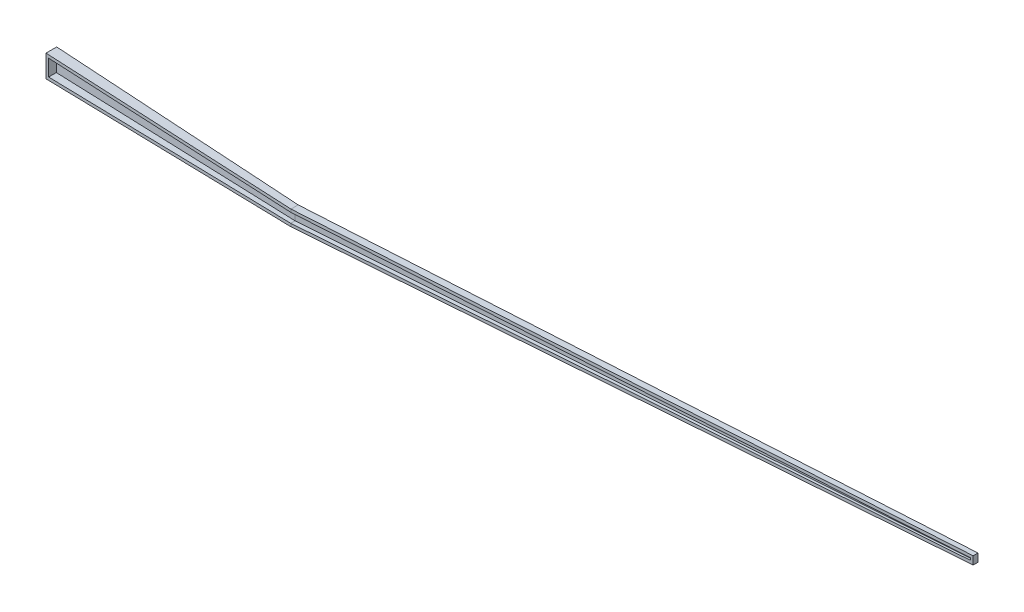
ISO-10303-21;
HEADER;
FILE_DESCRIPTION(('STEP AP214'),'2;1');
FILE_NAME('part.step','',(''),(''),'','','');
FILE_SCHEMA(('AUTOMOTIVE_DESIGN { 1 0 10303 214 1 1 1 1 }'));
ENDSEC;
DATA;
#1=APPLICATION_CONTEXT('core data for automotive mechanical design processes');
#2=APPLICATION_PROTOCOL_DEFINITION('international standard','automotive_design',2000,#1);
#3=PRODUCT_CONTEXT('',#1,'mechanical');
#4=PRODUCT('Part','Part','',(#3));
#5=PRODUCT_RELATED_PRODUCT_CATEGORY('part','',(#4));
#6=PRODUCT_DEFINITION_FORMATION('','',#4);
#7=PRODUCT_DEFINITION_CONTEXT('part definition',#1,'design');
#8=PRODUCT_DEFINITION('design','',#6,#7);
#9=PRODUCT_DEFINITION_SHAPE('','',#8);
#10=(LENGTH_UNIT() NAMED_UNIT(*) SI_UNIT(.MILLI.,.METRE.));
#11=(NAMED_UNIT(*) PLANE_ANGLE_UNIT() SI_UNIT($,.RADIAN.));
#12=(NAMED_UNIT(*) SI_UNIT($,.STERADIAN.) SOLID_ANGLE_UNIT());
#13=UNCERTAINTY_MEASURE_WITH_UNIT(LENGTH_MEASURE(1.E-05),#10,'distance_accuracy_value','');
#14=(GEOMETRIC_REPRESENTATION_CONTEXT(3) GLOBAL_UNCERTAINTY_ASSIGNED_CONTEXT((#13)) GLOBAL_UNIT_ASSIGNED_CONTEXT((#10,
#11,#12)) REPRESENTATION_CONTEXT('',''));
#15=CARTESIAN_POINT('',(0.,0.,0.));
#16=DIRECTION('',(0.,0.,1.));
#17=DIRECTION('',(1.,0.,0.));
#18=AXIS2_PLACEMENT_3D('',#15,#16,#17);
#19=CARTESIAN_POINT('',(-27.6683419660114,0.,256.547332608968));
#20=DIRECTION('',(0.107227081332726,0.,-0.994234556344158));
#21=DIRECTION('',(-0.994234556344158,0.,-0.107227081332726));
#22=AXIS2_PLACEMENT_3D('',#19,#20,#21);
#23=PLANE('',#22);
#24=DIRECTION('',(0.989050782276175,0.101982764246963,0.106668017115886));
#25=VECTOR('',#24,1.);
#26=CARTESIAN_POINT('',(-15.9796338971619,-114.678133572057,257.807946659018));
#27=LINE('',#26,#25);
#28=CARTESIAN_POINT('',(939.052877239833,-16.2030530435097,360.807131402338));
#29=VERTEX_POINT('',#28);
#30=CARTESIAN_POINT('',(940.,-16.1053935513037,360.909277529314));
#31=VERTEX_POINT('',#30);
#32=EDGE_CURVE('E202',#29,#31,#27,.T.);
#33=ORIENTED_EDGE('',*,*,#32,.F.);
#34=DIRECTION('',(0.990521140499442,0.0863478379775976,0.106826593600468));
#35=VECTOR('',#34,1.);
#36=CARTESIAN_POINT('',(-19.0746809991996,-99.7270080385337,257.474149301824));
#37=LINE('',#36,#35);
#38=CARTESIAN_POINT('',(10.,-97.1924474506563,260.60982102469));
#39=VERTEX_POINT('',#38);
#40=EDGE_CURVE('E175',#39,#29,#37,.T.);
#41=ORIENTED_EDGE('',*,*,#40,.F.);
#42=DIRECTION('',(0.,-1.,0.));
#43=VECTOR('',#42,1.);
#44=CARTESIAN_POINT('',(10.,0.,260.60982102469));
#45=LINE('',#44,#43);
#46=CARTESIAN_POINT('',(10.,-41.2284540604462,260.60982102469));
#47=VERTEX_POINT('',#46);
#48=EDGE_CURVE('E153',#47,#39,#45,.T.);
#49=ORIENTED_EDGE('',*,*,#48,.F.);
#50=DIRECTION('',(0.992348001521647,0.0615742556318157,0.107023618511905));
#51=VECTOR('',#50,1.);
#52=CARTESIAN_POINT('',(-25.0063407109826,-43.4005644172639,256.834426457456));
#53=LINE('',#52,#51);
#54=CARTESIAN_POINT('',(940.,16.4771670017024,360.909277529314));
#55=VERTEX_POINT('',#54);
#56=EDGE_CURVE('E165',#47,#55,#53,.T.);
#57=ORIENTED_EDGE('',*,*,#56,.T.);
#58=DIRECTION('',(0.,-1.,0.));
#59=VECTOR('',#58,1.);
#60=CARTESIAN_POINT('',(940.,26.496398934414,360.909277529314));
#61=LINE('',#60,#59);
#62=CARTESIAN_POINT('',(940.,26.496398934414,360.909277529314));
#63=VERTEX_POINT('',#62);
#64=EDGE_CURVE('E49',#63,#55,#61,.T.);
#65=ORIENTED_EDGE('',*,*,#64,.F.);
#66=DIRECTION('',(0.992348001521646,0.0615742556318157,0.107023618511905));
#67=VECTOR('',#66,1.);
#68=CARTESIAN_POINT('',(0.,-31.82971267679,259.53133224507));
#69=LINE('',#68,#67);
#70=CARTESIAN_POINT('',(0.,-31.82971267679,259.53133224507));
#71=VERTEX_POINT('',#70);
#72=EDGE_CURVE('E494',#71,#63,#69,.T.);
#73=ORIENTED_EDGE('',*,*,#72,.F.);
#74=DIRECTION('',(0.,-1.,0.));
#75=VECTOR('',#74,1.);
#76=CARTESIAN_POINT('',(0.,-31.82971267679,259.53133224507));
#77=LINE('',#76,#75);
#78=CARTESIAN_POINT('',(0.,-108.102113692959,259.53133224507));
#79=VERTEX_POINT('',#78);
#80=EDGE_CURVE('E479',#71,#79,#77,.T.);
#81=ORIENTED_EDGE('',*,*,#80,.T.);
#82=DIRECTION('',(0.990521140499442,0.0863478379775976,0.106826593600468));
#83=VECTOR('',#82,1.);
#84=CARTESIAN_POINT('',(0.,-108.102113692959,259.53133224507));
#85=LINE('',#84,#83);
#86=CARTESIAN_POINT('',(940.,-26.1584131698027,360.909277529314));
#87=VERTEX_POINT('',#86);
#88=EDGE_CURVE('E487',#79,#87,#85,.T.);
#89=ORIENTED_EDGE('',*,*,#88,.T.);
#90=EDGE_CURVE('E43',#31,#87,#61,.T.);
#91=ORIENTED_EDGE('',*,*,#90,.F.);
#92=EDGE_LOOP('',(#33,#41,#49,#57,#65,#73,#81,#89,#91));
#93=FACE_BOUND('',#92,.T.);
#94=ADVANCED_FACE('F38',(#93),#23,.F.);
#95=CARTESIAN_POINT('',(0.,0.,0.));
#96=DIRECTION('',(-1.,0.,0.));
#97=DIRECTION('',(0.,0.,1.));
#98=AXIS2_PLACEMENT_3D('',#95,#96,#97);
#99=PLANE('',#98);
#100=DIRECTION('',(0.,1.,0.));
#101=VECTOR('',#100,1.);
#102=CARTESIAN_POINT('',(0.,-31.82971267679,222.920579757309));
#103=LINE('',#102,#101);
#104=CARTESIAN_POINT('',(0.,-108.102113692959,222.920579757309));
#105=VERTEX_POINT('',#104);
#106=CARTESIAN_POINT('',(0.,-31.82971267679,222.920579757309));
#107=VERTEX_POINT('',#106);
#108=EDGE_CURVE('E319',#105,#107,#103,.T.);
#109=ORIENTED_EDGE('',*,*,#108,.F.);
#110=DIRECTION('',(0.,0.,-1.));
#111=VECTOR('',#110,1.);
#112=CARTESIAN_POINT('',(0.,-108.102113692959,222.920579757309));
#113=LINE('',#112,#111);
#114=EDGE_CURVE('E473',#79,#105,#113,.T.);
#115=ORIENTED_EDGE('',*,*,#114,.F.);
#116=ORIENTED_EDGE('',*,*,#80,.F.);
#117=DIRECTION('',(0.,0.,1.));
#118=VECTOR('',#117,1.);
#119=CARTESIAN_POINT('',(0.,-31.82971267679,222.920579757309));
#120=LINE('',#119,#118);
#121=EDGE_CURVE('E381',#107,#71,#120,.T.);
#122=ORIENTED_EDGE('',*,*,#121,.F.);
#123=EDGE_LOOP('',(#109,#115,#116,#122));
#124=FACE_BOUND('',#123,.T.);
#125=ADVANCED_FACE('F399',(#124),#99,.T.);
#126=CARTESIAN_POINT('',(1.96742882089534,-31.7076355778595,0.));
#127=DIRECTION('',(0.0619299516392605,-0.998080498301594,0.));
#128=DIRECTION('',(0.998080498301595,0.0619299516392605,0.));
#129=AXIS2_PLACEMENT_3D('',#126,#127,#128);
#130=PLANE('',#129);
#131=ORIENTED_EDGE('',*,*,#72,.T.);
#132=DIRECTION('',(0.,0.,1.));
#133=VECTOR('',#132,1.);
#134=CARTESIAN_POINT('',(940.,26.496398934414,336.130542421448));
#135=LINE('',#134,#133);
#136=CARTESIAN_POINT('',(940.,26.496398934414,336.130542421448));
#137=VERTEX_POINT('',#136);
#138=EDGE_CURVE('E11',#137,#63,#135,.T.);
#139=ORIENTED_EDGE('',*,*,#138,.F.);
#140=DIRECTION('',(0.990946963731779,0.0614873225610675,0.1193458178364));
#141=VECTOR('',#140,1.);
#142=CARTESIAN_POINT('',(0.,-31.82971267679,222.920579757309));
#143=LINE('',#142,#141);
#144=EDGE_CURVE('E387',#107,#137,#143,.T.);
#145=ORIENTED_EDGE('',*,*,#144,.F.);
#146=ORIENTED_EDGE('',*,*,#121,.T.);
#147=EDGE_LOOP('',(#131,#139,#145,#146));
#148=FACE_BOUND('',#147,.T.);
#149=ADVANCED_FACE('F389',(#148),#130,.F.);
#150=CARTESIAN_POINT('',(9.35263603010326,-107.28680560152,0.));
#151=DIRECTION('',(-0.0868447928098985,0.996221853786498,0.));
#152=DIRECTION('',(-0.996221853786498,-0.0868447928098985,0.));
#153=AXIS2_PLACEMENT_3D('',#150,#151,#152);
#154=PLANE('',#153);
#155=DIRECTION('',(0.989127815337359,0.0862263760416262,0.119126726642982));
#156=VECTOR('',#155,1.);
#157=CARTESIAN_POINT('',(0.,-108.102113692959,222.920579757309));
#158=LINE('',#157,#156);
#159=CARTESIAN_POINT('',(940.,-26.1584131698026,336.130542421448));
#160=VERTEX_POINT('',#159);
#161=EDGE_CURVE('E492',#105,#160,#158,.T.);
#162=ORIENTED_EDGE('',*,*,#161,.T.);
#163=DIRECTION('',(0.,0.,-1.));
#164=VECTOR('',#163,1.);
#165=CARTESIAN_POINT('',(940.,-26.1584131698027,336.130542421448));
#166=LINE('',#165,#164);
#167=EDGE_CURVE('E438',#87,#160,#166,.T.);
#168=ORIENTED_EDGE('',*,*,#167,.F.);
#169=ORIENTED_EDGE('',*,*,#88,.F.);
#170=ORIENTED_EDGE('',*,*,#114,.T.);
#171=EDGE_LOOP('',(#162,#168,#169,#170));
#172=FACE_BOUND('',#171,.T.);
#173=ADVANCED_FACE('F398',(#172),#154,.F.);
#174=CARTESIAN_POINT('',(-26.4638377315925,0.,219.733377542901));
#175=DIRECTION('',(-0.119572064384979,0.,0.99282552415755));
#176=DIRECTION('',(0.99282552415755,0.,0.119572064384979));
#177=AXIS2_PLACEMENT_3D('',#174,#175,#176);
#178=PLANE('',#177);
#179=ORIENTED_EDGE('',*,*,#144,.T.);
#180=DIRECTION('',(0.,1.,0.));
#181=VECTOR('',#180,1.);
#182=CARTESIAN_POINT('',(940.,26.496398934414,336.130542421448));
#183=LINE('',#182,#181);
#184=EDGE_CURVE('E268',#160,#137,#183,.T.);
#185=ORIENTED_EDGE('',*,*,#184,.F.);
#186=ORIENTED_EDGE('',*,*,#161,.F.);
#187=ORIENTED_EDGE('',*,*,#108,.T.);
#188=EDGE_LOOP('',(#179,#185,#186,#187));
#189=FACE_BOUND('',#188,.T.);
#190=ADVANCED_FACE('F40',(#189),#178,.F.);
#191=CARTESIAN_POINT('',(3360.,0.,0.));
#192=DIRECTION('',(1.,0.,0.));
#193=DIRECTION('',(0.,0.,-1.));
#194=AXIS2_PLACEMENT_3D('',#191,#192,#193);
#195=PLANE('',#194);
#196=DIRECTION('',(0.,-1.,0.));
#197=VECTOR('',#196,1.);
#198=CARTESIAN_POINT('',(3360.,250.933091078658,445.49960602284));
#199=LINE('',#198,#197);
#200=CARTESIAN_POINT('',(3360.,250.933091078658,445.49960602284));
#201=VERTEX_POINT('',#200);
#202=CARTESIAN_POINT('',(3360.,223.372039563549,445.49960602284));
#203=VERTEX_POINT('',#202);
#204=EDGE_CURVE('E219',#201,#203,#199,.T.);
#205=ORIENTED_EDGE('',*,*,#204,.T.);
#206=DIRECTION('',(0.,0.,-1.));
#207=VECTOR('',#206,1.);
#208=CARTESIAN_POINT('',(3360.,223.372039563549,445.49960602284));
#209=LINE('',#208,#207);
#210=CARTESIAN_POINT('',(3360.,223.372039563549,429.051881731565));
#211=VERTEX_POINT('',#210);
#212=EDGE_CURVE('E309',#203,#211,#209,.T.);
#213=ORIENTED_EDGE('',*,*,#212,.T.);
#214=DIRECTION('',(0.,1.,0.));
#215=VECTOR('',#214,1.);
#216=CARTESIAN_POINT('',(3360.,250.933091078658,429.051881731565));
#217=LINE('',#216,#215);
#218=CARTESIAN_POINT('',(3360.,250.933091078658,429.051881731565));
#219=VERTEX_POINT('',#218);
#220=EDGE_CURVE('E341',#211,#219,#217,.T.);
#221=ORIENTED_EDGE('',*,*,#220,.T.);
#222=DIRECTION('',(0.,0.,1.));
#223=VECTOR('',#222,1.);
#224=CARTESIAN_POINT('',(3360.,250.933091078658,445.49960602284));
#225=LINE('',#224,#223);
#226=EDGE_CURVE('E227',#219,#201,#225,.T.);
#227=ORIENTED_EDGE('',*,*,#226,.T.);
#228=EDGE_LOOP('',(#205,#213,#221,#227));
#229=FACE_BOUND('',#228,.T.);
#230=ADVANCED_FACE('F246',(#229),#195,.T.);
#231=CARTESIAN_POINT('',(5.57975672891792,-60.1640095252477,0.));
#232=DIRECTION('',(-0.0923461431479787,0.995726965510974,0.));
#233=DIRECTION('',(-0.995726965510975,-0.0923461431479787,0.));
#234=AXIS2_PLACEMENT_3D('',#231,#232,#233);
#235=PLANE('',#234);
#236=DIRECTION('',(-0.994999997689863,-0.0922787223822492,-0.038205261321862));
#237=VECTOR('',#236,1.);
#238=CARTESIAN_POINT('',(3360.,250.933091078658,429.051881731565));
#239=LINE('',#238,#237);
#240=EDGE_CURVE('E233',#219,#137,#239,.T.);
#241=ORIENTED_EDGE('',*,*,#240,.T.);
#242=ORIENTED_EDGE('',*,*,#138,.T.);
#243=DIRECTION('',(-0.995124396020932,-0.0922902593863539,-0.034784256012947));
#244=VECTOR('',#243,1.);
#245=CARTESIAN_POINT('',(3360.,250.933091078658,445.49960602284));
#246=LINE('',#245,#244);
#247=EDGE_CURVE('E301',#201,#63,#246,.T.);
#248=ORIENTED_EDGE('',*,*,#247,.F.);
#249=ORIENTED_EDGE('',*,*,#226,.F.);
#250=EDGE_LOOP('',(#241,#242,#248,#249));
#251=FACE_BOUND('',#250,.T.);
#252=ADVANCED_FACE('F235',(#251),#235,.T.);
#253=CARTESIAN_POINT('',(-11.4529552220833,0.,327.651542806847));
#254=DIRECTION('',(-0.0349333464098144,0.,0.999389644387319));
#255=DIRECTION('',(0.999389644387319,0.,0.0349333464098144));
#256=AXIS2_PLACEMENT_3D('',#253,#254,#255);
#257=PLANE('',#256);
#258=DIRECTION('',(-0.997473648552157,-0.0618922971858383,-0.0348663733862241));
#259=VECTOR('',#258,1.);
#260=CARTESIAN_POINT('',(-8.82549914049115,-42.3965584902387,327.743384696535));
#261=LINE('',#260,#259);
#262=CARTESIAN_POINT('',(940.771559993538,16.5250415701044,360.936247162912));
#263=VERTEX_POINT('',#262);
#264=EDGE_CURVE('E215',#263,#55,#261,.T.);
#265=ORIENTED_EDGE('',*,*,#264,.F.);
#266=DIRECTION('',(-0.995124396020932,-0.0922902593863539,-0.034784256012947));
#267=VECTOR('',#266,1.);
#268=CARTESIAN_POINT('',(-4.86005514028849,-71.1751368132239,327.881995527361));
#269=LINE('',#268,#267);
#270=CARTESIAN_POINT('',(3350.,239.962753014272,445.150059210883));
#271=VERTEX_POINT('',#270);
#272=EDGE_CURVE('E186',#271,#263,#269,.T.);
#273=ORIENTED_EDGE('',*,*,#272,.F.);
#274=DIRECTION('',(0.,-1.,0.));
#275=VECTOR('',#274,1.);
#276=CARTESIAN_POINT('',(3350.,0.,445.150059210883));
#277=LINE('',#276,#275);
#278=CARTESIAN_POINT('',(3350.,232.393941608769,445.150059210883));
#279=VERTEX_POINT('',#278);
#280=EDGE_CURVE('E196',#271,#279,#277,.T.);
#281=ORIENTED_EDGE('',*,*,#280,.T.);
#282=DIRECTION('',(-0.994125245499023,-0.102506001067366,-0.0347493310249872));
#283=VECTOR('',#282,1.);
#284=CARTESIAN_POINT('',(0.185618777664764,-113.011305961107,328.05836545058));
#285=LINE('',#284,#283);
#286=EDGE_CURVE('E57',#279,#31,#285,.T.);
#287=ORIENTED_EDGE('',*,*,#286,.T.);
#288=ORIENTED_EDGE('',*,*,#90,.T.);
#289=DIRECTION('',(-0.994125245499023,-0.102506001067366,-0.0347493310249872));
#290=VECTOR('',#289,1.);
#291=CARTESIAN_POINT('',(3360.,223.372039563549,445.49960602284));
#292=LINE('',#291,#290);
#293=EDGE_CURVE('E300',#203,#87,#292,.T.);
#294=ORIENTED_EDGE('',*,*,#293,.F.);
#295=ORIENTED_EDGE('',*,*,#204,.F.);
#296=ORIENTED_EDGE('',*,*,#247,.T.);
#297=ORIENTED_EDGE('',*,*,#64,.T.);
#298=EDGE_LOOP('',(#265,#273,#281,#287,#288,#294,#295,#296,#297));
#299=FACE_BOUND('',#298,.T.);
#300=ADVANCED_FACE('F245',(#299),#257,.T.);
#301=CARTESIAN_POINT('',(-11.5036395950585,0.,299.595421533173));
#302=DIRECTION('',(0.03836897344482,0.,-0.999263639825242));
#303=DIRECTION('',(-0.999263639825242,0.,-0.03836897344482));
#304=AXIS2_PLACEMENT_3D('',#301,#302,#303);
#305=PLANE('',#304);
#306=DIRECTION('',(-0.994001221450069,-0.102493212729727,-0.0381669110632369));
#307=VECTOR('',#306,1.);
#308=CARTESIAN_POINT('',(3360.,223.372039563549,429.051881731565));
#309=LINE('',#308,#307);
#310=EDGE_CURVE('E293',#211,#160,#309,.T.);
#311=ORIENTED_EDGE('',*,*,#310,.T.);
#312=ORIENTED_EDGE('',*,*,#184,.T.);
#313=ORIENTED_EDGE('',*,*,#240,.F.);
#314=ORIENTED_EDGE('',*,*,#220,.F.);
#315=EDGE_LOOP('',(#311,#312,#313,#314));
#316=FACE_BOUND('',#315,.T.);
#317=ADVANCED_FACE('F274',(#316),#305,.T.);
#318=CARTESIAN_POINT('',(12.5578370236541,-121.788604414218,0.));
#319=DIRECTION('',(0.102567945991165,-0.994726000693233,0.));
#320=DIRECTION('',(0.994726000693233,0.102567945991165,0.));
#321=AXIS2_PLACEMENT_3D('',#318,#319,#320);
#322=PLANE('',#321);
#323=ORIENTED_EDGE('',*,*,#293,.T.);
#324=ORIENTED_EDGE('',*,*,#167,.T.);
#325=ORIENTED_EDGE('',*,*,#310,.F.);
#326=ORIENTED_EDGE('',*,*,#212,.F.);
#327=EDGE_LOOP('',(#323,#324,#325,#326));
#328=FACE_BOUND('',#327,.T.);
#329=ADVANCED_FACE('F283',(#328),#322,.T.);
#330=CARTESIAN_POINT('',(10.,0.,0.));
#331=DIRECTION('',(-1.,0.,0.));
#332=DIRECTION('',(0.,0.,1.));
#333=AXIS2_PLACEMENT_3D('',#330,#331,#332);
#334=PLANE('',#333);
#335=DIRECTION('',(0.,1.,0.));
#336=VECTOR('',#335,1.);
#337=CARTESIAN_POINT('',(10.,0.,234.197204271319));
#338=LINE('',#337,#336);
#339=CARTESIAN_POINT('',(10.,-97.1924474506563,234.197204271319));
#340=VERTEX_POINT('',#339);
#341=CARTESIAN_POINT('',(10.,-41.2284540604462,234.197204271319));
#342=VERTEX_POINT('',#341);
#343=EDGE_CURVE('E150',#340,#342,#338,.T.);
#344=ORIENTED_EDGE('',*,*,#343,.T.);
#345=DIRECTION('',(0.,0.,1.));
#346=VECTOR('',#345,1.);
#347=CARTESIAN_POINT('',(10.,-41.2284540604462,0.));
#348=LINE('',#347,#346);
#349=EDGE_CURVE('E173',#342,#47,#348,.T.);
#350=ORIENTED_EDGE('',*,*,#349,.T.);
#351=ORIENTED_EDGE('',*,*,#48,.T.);
#352=DIRECTION('',(0.,0.,-1.));
#353=VECTOR('',#352,1.);
#354=CARTESIAN_POINT('',(10.,-97.1924474506563,0.));
#355=LINE('',#354,#353);
#356=EDGE_CURVE('E145',#39,#340,#355,.T.);
#357=ORIENTED_EDGE('',*,*,#356,.T.);
#358=EDGE_LOOP('',(#344,#350,#351,#357));
#359=FACE_BOUND('',#358,.T.);
#360=ADVANCED_FACE('F147',(#359),#334,.F.);
#361=CARTESIAN_POINT('',(2.58672833728794,-41.6884405608755,0.));
#362=DIRECTION('',(0.0619299516392605,-0.998080498301594,0.));
#363=DIRECTION('',(0.998080498301595,0.0619299516392605,0.));
#364=AXIS2_PLACEMENT_3D('',#361,#362,#363);
#365=PLANE('',#364);
#366=ORIENTED_EDGE('',*,*,#56,.F.);
#367=ORIENTED_EDGE('',*,*,#349,.F.);
#368=DIRECTION('',(0.990946963731779,0.0614873225610675,0.1193458178364));
#369=VECTOR('',#368,1.);
#370=CARTESIAN_POINT('',(-25.0051016683728,-43.4004875358409,229.98132527884));
#371=LINE('',#370,#369);
#372=CARTESIAN_POINT('',(939.208982633409,16.4280851216916,346.107538559734));
#373=VERTEX_POINT('',#372);
#374=EDGE_CURVE('E164',#342,#373,#371,.T.);
#375=ORIENTED_EDGE('',*,*,#374,.T.);
#376=DIRECTION('',(-0.997348367225793,-0.0618845235979401,-0.038295432248504));
#377=VECTOR('',#376,1.);
#378=CARTESIAN_POINT('',(-9.25886969622252,-42.4234487236457,309.6889835469));
#379=LINE('',#378,#377);
#380=CARTESIAN_POINT('',(940.771559993538,16.5250415701043,346.167537229602));
#381=VERTEX_POINT('',#380);
#382=EDGE_CURVE('E199',#381,#373,#379,.T.);
#383=ORIENTED_EDGE('',*,*,#382,.F.);
#384=DIRECTION('',(0.,0.,1.));
#385=VECTOR('',#384,1.);
#386=CARTESIAN_POINT('',(940.771559993538,16.5250415701043,0.));
#387=LINE('',#386,#385);
#388=EDGE_CURVE('E176',#381,#263,#387,.T.);
#389=ORIENTED_EDGE('',*,*,#388,.T.);
#390=ORIENTED_EDGE('',*,*,#264,.T.);
#391=EDGE_LOOP('',(#366,#367,#375,#383,#389,#390));
#392=FACE_BOUND('',#391,.T.);
#393=ADVANCED_FACE('F593',(#392),#365,.T.);
#394=CARTESIAN_POINT('',(8.48418810200428,-97.324587063655,0.));
#395=DIRECTION('',(-0.0868447928098985,0.996221853786498,0.));
#396=DIRECTION('',(-0.996221853786498,-0.0868447928098985,0.));
#397=AXIS2_PLACEMENT_3D('',#394,#395,#396);
#398=PLANE('',#397);
#399=DIRECTION('',(0.989127815337359,0.0862263760416262,0.119126726642982));
#400=VECTOR('',#399,1.);
#401=CARTESIAN_POINT('',(-19.0901224059608,-99.728354130035,230.693702493155));
#402=LINE('',#401,#400);
#403=CARTESIAN_POINT('',(939.052877239835,-16.2030530435096,346.088737830183));
#404=VERTEX_POINT('',#403);
#405=EDGE_CURVE('E159',#340,#404,#402,.T.);
#406=ORIENTED_EDGE('',*,*,#405,.F.);
#407=ORIENTED_EDGE('',*,*,#356,.F.);
#408=ORIENTED_EDGE('',*,*,#40,.T.);
#409=DIRECTION('',(0.,0.,-1.));
#410=VECTOR('',#409,1.);
#411=CARTESIAN_POINT('',(939.052877239835,-16.2030530435096,0.));
#412=LINE('',#411,#410);
#413=EDGE_CURVE('E161',#29,#404,#412,.T.);
#414=ORIENTED_EDGE('',*,*,#413,.T.);
#415=EDGE_LOOP('',(#406,#407,#408,#414));
#416=FACE_BOUND('',#415,.T.);
#417=ADVANCED_FACE('F160',(#416),#398,.T.);
#418=CARTESIAN_POINT('',(-27.6595583754423,0.,229.661632784477));
#419=DIRECTION('',(-0.119572064384979,0.,0.99282552415755));
#420=DIRECTION('',(0.99282552415755,0.,0.119572064384979));
#421=AXIS2_PLACEMENT_3D('',#418,#419,#420);
#422=PLANE('',#421);
#423=ORIENTED_EDGE('',*,*,#374,.F.);
#424=ORIENTED_EDGE('',*,*,#343,.F.);
#425=ORIENTED_EDGE('',*,*,#405,.T.);
#426=DIRECTION('',(-0.987663644105561,-0.101839733992534,-0.118950387525444));
#427=VECTOR('',#426,1.);
#428=CARTESIAN_POINT('',(-16.0037051074598,-114.680615596852,231.065418649676));
#429=LINE('',#428,#427);
#430=CARTESIAN_POINT('',(939.208982633409,-16.1869567420498,346.107538559734));
#431=VERTEX_POINT('',#430);
#432=EDGE_CURVE('E179',#431,#404,#429,.T.);
#433=ORIENTED_EDGE('',*,*,#432,.F.);
#434=DIRECTION('',(0.,1.,0.));
#435=VECTOR('',#434,1.);
#436=CARTESIAN_POINT('',(939.208982633409,0.,346.107538559734));
#437=LINE('',#436,#435);
#438=EDGE_CURVE('E181',#431,#373,#437,.T.);
#439=ORIENTED_EDGE('',*,*,#438,.T.);
#440=EDGE_LOOP('',(#423,#424,#425,#433,#439));
#441=FACE_BOUND('',#440,.T.);
#442=ADVANCED_FACE('F167',(#441),#422,.T.);
#443=CARTESIAN_POINT('',(3350.,0.,0.));
#444=DIRECTION('',(1.,0.,0.));
#445=DIRECTION('',(0.,0.,-1.));
#446=AXIS2_PLACEMENT_3D('',#443,#444,#445);
#447=PLANE('',#446);
#448=ORIENTED_EDGE('',*,*,#280,.F.);
#449=DIRECTION('',(0.,0.,1.));
#450=VECTOR('',#449,1.);
#451=CARTESIAN_POINT('',(3350.,239.962753014272,0.));
#452=LINE('',#451,#450);
#453=CARTESIAN_POINT('',(3350.,239.962753014272,438.675278283083));
#454=VERTEX_POINT('',#453);
#455=EDGE_CURVE('E190',#454,#271,#452,.T.);
#456=ORIENTED_EDGE('',*,*,#455,.F.);
#457=DIRECTION('',(0.,1.,0.));
#458=VECTOR('',#457,1.);
#459=CARTESIAN_POINT('',(3350.,0.,438.675278283083));
#460=LINE('',#459,#458);
#461=CARTESIAN_POINT('',(3350.,232.393941608769,438.675278283083));
#462=VERTEX_POINT('',#461);
#463=EDGE_CURVE('E191',#462,#454,#460,.T.);
#464=ORIENTED_EDGE('',*,*,#463,.F.);
#465=DIRECTION('',(0.,0.,-1.));
#466=VECTOR('',#465,1.);
#467=CARTESIAN_POINT('',(3350.,232.393941608769,0.));
#468=LINE('',#467,#466);
#469=EDGE_CURVE('E194',#279,#462,#468,.T.);
#470=ORIENTED_EDGE('',*,*,#469,.F.);
#471=EDGE_LOOP('',(#448,#456,#464,#470));
#472=FACE_BOUND('',#471,.T.);
#473=ADVANCED_FACE('F619',(#472),#447,.F.);
#474=CARTESIAN_POINT('',(6.5032181603977,-70.1212791803574,0.));
#475=DIRECTION('',(-0.0923461431479787,0.995726965510974,0.));
#476=DIRECTION('',(-0.995726965510975,-0.0923461431479787,0.));
#477=AXIS2_PLACEMENT_3D('',#474,#475,#476);
#478=PLANE('',#477);
#479=DIRECTION('',(-0.994999997689863,-0.0922787223822492,-0.038205261321862));
#480=VECTOR('',#479,1.);
#481=CARTESIAN_POINT('',(-5.29237861978361,-71.2152315453207,309.841285887059));
#482=LINE('',#481,#480);
#483=EDGE_CURVE('E187',#454,#381,#482,.T.);
#484=ORIENTED_EDGE('',*,*,#483,.F.);
#485=ORIENTED_EDGE('',*,*,#455,.T.);
#486=ORIENTED_EDGE('',*,*,#272,.T.);
#487=ORIENTED_EDGE('',*,*,#388,.F.);
#488=EDGE_LOOP('',(#484,#485,#486,#487));
#489=FACE_BOUND('',#488,.T.);
#490=ADVANCED_FACE('F628',(#489),#478,.F.);
#491=CARTESIAN_POINT('',(-11.8873293295067,0.,309.588057931426));
#492=DIRECTION('',(0.03836897344482,0.,-0.999263639825242));
#493=DIRECTION('',(-0.999263639825242,0.,-0.03836897344482));
#494=AXIS2_PLACEMENT_3D('',#491,#492,#493);
#495=PLANE('',#494);
#496=DIRECTION('',(-0.994001221450069,-0.102493212729727,-0.0381669110632369));
#497=VECTOR('',#496,1.);
#498=CARTESIAN_POINT('',(-0.247096096360123,-113.05592395219,310.035010849569));
#499=LINE('',#498,#497);
#500=EDGE_CURVE('E170',#462,#431,#499,.T.);
#501=ORIENTED_EDGE('',*,*,#500,.F.);
#502=ORIENTED_EDGE('',*,*,#463,.T.);
#503=ORIENTED_EDGE('',*,*,#483,.T.);
#504=ORIENTED_EDGE('',*,*,#382,.T.);
#505=ORIENTED_EDGE('',*,*,#438,.F.);
#506=EDGE_LOOP('',(#501,#502,#503,#504,#505));
#507=FACE_BOUND('',#506,.T.);
#508=ADVANCED_FACE('F638',(#507),#495,.F.);
#509=CARTESIAN_POINT('',(11.5321575637425,-111.841344407286,0.));
#510=DIRECTION('',(0.102567945991165,-0.994726000693233,0.));
#511=DIRECTION('',(0.994726000693233,0.102567945991165,0.));
#512=AXIS2_PLACEMENT_3D('',#509,#510,#511);
#513=PLANE('',#512);
#514=ORIENTED_EDGE('',*,*,#286,.F.);
#515=ORIENTED_EDGE('',*,*,#469,.T.);
#516=ORIENTED_EDGE('',*,*,#500,.T.);
#517=ORIENTED_EDGE('',*,*,#432,.T.);
#518=ORIENTED_EDGE('',*,*,#413,.F.);
#519=ORIENTED_EDGE('',*,*,#32,.T.);
#520=EDGE_LOOP('',(#514,#515,#516,#517,#518,#519));
#521=FACE_BOUND('',#520,.T.);
#522=ADVANCED_FACE('F648',(#521),#513,.F.);
#523=CLOSED_SHELL('',(#94,#125,#149,#173,#190,#230,#252,#300,#317,#329,#360,#393,#417,#442,#473,
#490,#508,#522));
#524=MANIFOLD_SOLID_BREP('B2',#523);
#525=ADVANCED_BREP_SHAPE_REPRESENTATION('',(#18,#524),#14);
#526=SHAPE_DEFINITION_REPRESENTATION(#9,#525);
ENDSEC;
END-ISO-10303-21;
